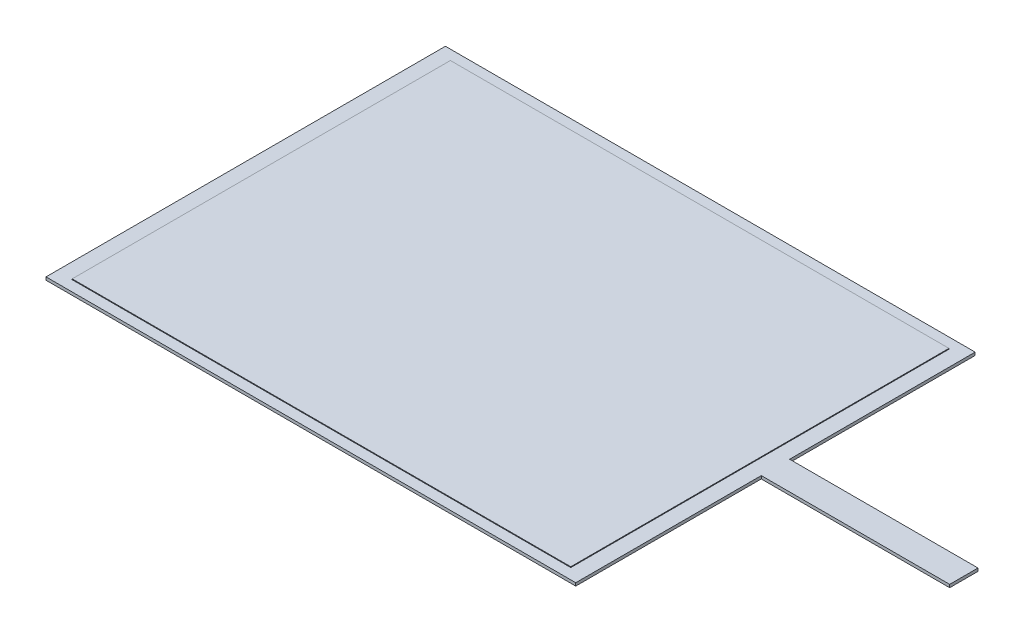
ISO-10303-21;
HEADER;
FILE_DESCRIPTION(('STEP AP214'),'2;1');
FILE_NAME('part.step','',(''),(''),'','','');
FILE_SCHEMA(('AUTOMOTIVE_DESIGN { 1 0 10303 214 1 1 1 1 }'));
ENDSEC;
DATA;
#1=APPLICATION_CONTEXT('core data for automotive mechanical design processes');
#2=APPLICATION_PROTOCOL_DEFINITION('international standard','automotive_design',2000,#1);
#3=PRODUCT_CONTEXT('',#1,'mechanical');
#4=PRODUCT('Part','Part','',(#3));
#5=PRODUCT_RELATED_PRODUCT_CATEGORY('part','',(#4));
#6=PRODUCT_DEFINITION_FORMATION('','',#4);
#7=PRODUCT_DEFINITION_CONTEXT('part definition',#1,'design');
#8=PRODUCT_DEFINITION('design','',#6,#7);
#9=PRODUCT_DEFINITION_SHAPE('','',#8);
#10=(LENGTH_UNIT() NAMED_UNIT(*) SI_UNIT(.MILLI.,.METRE.));
#11=(NAMED_UNIT(*) PLANE_ANGLE_UNIT() SI_UNIT($,.RADIAN.));
#12=(NAMED_UNIT(*) SI_UNIT($,.STERADIAN.) SOLID_ANGLE_UNIT());
#13=UNCERTAINTY_MEASURE_WITH_UNIT(LENGTH_MEASURE(1.E-05),#10,'distance_accuracy_value','');
#14=(GEOMETRIC_REPRESENTATION_CONTEXT(3) GLOBAL_UNCERTAINTY_ASSIGNED_CONTEXT((#13)) GLOBAL_UNIT_ASSIGNED_CONTEXT((#10,
#11,#12)) REPRESENTATION_CONTEXT('',''));
#15=CARTESIAN_POINT('',(0.,0.,0.));
#16=DIRECTION('',(0.,0.,1.));
#17=DIRECTION('',(1.,0.,0.));
#18=AXIS2_PLACEMENT_3D('',#15,#16,#17);
#19=CARTESIAN_POINT('',(0.,0.52,0.));
#20=DIRECTION('',(0.,1.,0.));
#21=DIRECTION('',(0.,0.,1.));
#22=AXIS2_PLACEMENT_3D('',#19,#20,#21);
#23=PLANE('',#22);
#24=DIRECTION('',(1.,0.,0.));
#25=VECTOR('',#24,1.);
#26=CARTESIAN_POINT('',(0.,0.52,70.5));
#27=LINE('',#26,#25);
#28=CARTESIAN_POINT('',(-93.5,0.52,70.5));
#29=VERTEX_POINT('',#28);
#30=CARTESIAN_POINT('',(93.5,0.52,70.5));
#31=VERTEX_POINT('',#30);
#32=EDGE_CURVE('E194',#29,#31,#27,.T.);
#33=ORIENTED_EDGE('',*,*,#32,.T.);
#34=DIRECTION('',(0.,0.,-1.));
#35=VECTOR('',#34,1.);
#36=CARTESIAN_POINT('',(93.5,0.52,0.));
#37=LINE('',#36,#35);
#38=CARTESIAN_POINT('',(93.5,0.52,5.));
#39=VERTEX_POINT('',#38);
#40=EDGE_CURVE('E197',#31,#39,#37,.T.);
#41=ORIENTED_EDGE('',*,*,#40,.T.);
#42=DIRECTION('',(-1.,0.,0.));
#43=VECTOR('',#42,1.);
#44=CARTESIAN_POINT('',(0.,0.52,4.99999999999998));
#45=LINE('',#44,#43);
#46=CARTESIAN_POINT('',(160.,0.52,5.));
#47=VERTEX_POINT('',#46);
#48=EDGE_CURVE('E200',#47,#39,#45,.T.);
#49=ORIENTED_EDGE('',*,*,#48,.F.);
#50=DIRECTION('',(0.,0.,-1.));
#51=VECTOR('',#50,1.);
#52=CARTESIAN_POINT('',(160.,0.52,0.));
#53=LINE('',#52,#51);
#54=CARTESIAN_POINT('',(160.,0.52,-5.));
#55=VERTEX_POINT('',#54);
#56=EDGE_CURVE('E204',#47,#55,#53,.T.);
#57=ORIENTED_EDGE('',*,*,#56,.T.);
#58=DIRECTION('',(-1.,0.,0.));
#59=VECTOR('',#58,1.);
#60=CARTESIAN_POINT('',(0.,0.52,-5.00000000000002));
#61=LINE('',#60,#59);
#62=CARTESIAN_POINT('',(93.5,0.52,-5.));
#63=VERTEX_POINT('',#62);
#64=EDGE_CURVE('E206',#55,#63,#61,.T.);
#65=ORIENTED_EDGE('',*,*,#64,.T.);
#66=CARTESIAN_POINT('',(93.5,0.52,-70.5));
#67=VERTEX_POINT('',#66);
#68=EDGE_CURVE('E201',#63,#67,#37,.T.);
#69=ORIENTED_EDGE('',*,*,#68,.T.);
#70=DIRECTION('',(1.,0.,0.));
#71=VECTOR('',#70,1.);
#72=CARTESIAN_POINT('',(0.,0.52,-70.5));
#73=LINE('',#72,#71);
#74=CARTESIAN_POINT('',(-93.5,0.52,-70.5));
#75=VERTEX_POINT('',#74);
#76=EDGE_CURVE('E208',#75,#67,#73,.T.);
#77=ORIENTED_EDGE('',*,*,#76,.F.);
#78=DIRECTION('',(0.,0.,-1.));
#79=VECTOR('',#78,1.);
#80=CARTESIAN_POINT('',(-93.5,0.52,0.));
#81=LINE('',#80,#79);
#82=EDGE_CURVE('E211',#29,#75,#81,.T.);
#83=ORIENTED_EDGE('',*,*,#82,.F.);
#84=EDGE_LOOP('',(#33,#41,#49,#57,#65,#69,#77,#83));
#85=FACE_BOUND('',#84,.T.);
#86=DIRECTION('',(0.,0.,1.));
#87=VECTOR('',#86,1.);
#88=CARTESIAN_POINT('',(88.,0.52,0.));
#89=LINE('',#88,#87);
#90=CARTESIAN_POINT('',(88.,0.52,-66.75));
#91=VERTEX_POINT('',#90);
#92=CARTESIAN_POINT('',(88.,0.52,66.75));
#93=VERTEX_POINT('',#92);
#94=EDGE_CURVE('E62',#91,#93,#89,.T.);
#95=ORIENTED_EDGE('',*,*,#94,.T.);
#96=DIRECTION('',(-1.,0.,0.));
#97=VECTOR('',#96,1.);
#98=CARTESIAN_POINT('',(0.,0.52,66.75));
#99=LINE('',#98,#97);
#100=CARTESIAN_POINT('',(-88.,0.52,66.75));
#101=VERTEX_POINT('',#100);
#102=EDGE_CURVE('E181',#93,#101,#99,.T.);
#103=ORIENTED_EDGE('',*,*,#102,.T.);
#104=DIRECTION('',(0.,0.,1.));
#105=VECTOR('',#104,1.);
#106=CARTESIAN_POINT('',(-88.,0.52,0.));
#107=LINE('',#106,#105);
#108=CARTESIAN_POINT('',(-88.,0.52,-66.75));
#109=VERTEX_POINT('',#108);
#110=EDGE_CURVE('E182',#109,#101,#107,.T.);
#111=ORIENTED_EDGE('',*,*,#110,.F.);
#112=DIRECTION('',(-1.,0.,0.));
#113=VECTOR('',#112,1.);
#114=CARTESIAN_POINT('',(0.,0.52,-66.75));
#115=LINE('',#114,#113);
#116=EDGE_CURVE('E67',#91,#109,#115,.T.);
#117=ORIENTED_EDGE('',*,*,#116,.F.);
#118=EDGE_LOOP('',(#95,#103,#111,#117));
#119=FACE_BOUND('',#118,.T.);
#120=ADVANCED_FACE('F47',(#85,#119),#23,.T.);
#121=CARTESIAN_POINT('',(0.,-0.52,0.));
#122=DIRECTION('',(0.,1.,0.));
#123=DIRECTION('',(0.,0.,1.));
#124=AXIS2_PLACEMENT_3D('',#121,#122,#123);
#125=PLANE('',#124);
#126=DIRECTION('',(1.,0.,0.));
#127=VECTOR('',#126,1.);
#128=CARTESIAN_POINT('',(0.,-0.52,70.5));
#129=LINE('',#128,#127);
#130=CARTESIAN_POINT('',(-93.5,-0.52,70.5));
#131=VERTEX_POINT('',#130);
#132=CARTESIAN_POINT('',(93.5,-0.52,70.5));
#133=VERTEX_POINT('',#132);
#134=EDGE_CURVE('E193',#131,#133,#129,.T.);
#135=ORIENTED_EDGE('',*,*,#134,.F.);
#136=DIRECTION('',(0.,0.,-1.));
#137=VECTOR('',#136,1.);
#138=CARTESIAN_POINT('',(-93.5,-0.52,0.));
#139=LINE('',#138,#137);
#140=CARTESIAN_POINT('',(-93.5,-0.52,-70.5));
#141=VERTEX_POINT('',#140);
#142=EDGE_CURVE('E198',#131,#141,#139,.T.);
#143=ORIENTED_EDGE('',*,*,#142,.T.);
#144=DIRECTION('',(1.,0.,0.));
#145=VECTOR('',#144,1.);
#146=CARTESIAN_POINT('',(0.,-0.52,-70.5));
#147=LINE('',#146,#145);
#148=CARTESIAN_POINT('',(93.5,-0.52,-70.5));
#149=VERTEX_POINT('',#148);
#150=EDGE_CURVE('E228',#141,#149,#147,.T.);
#151=ORIENTED_EDGE('',*,*,#150,.T.);
#152=DIRECTION('',(0.,0.,-1.));
#153=VECTOR('',#152,1.);
#154=CARTESIAN_POINT('',(93.5,-0.52,0.));
#155=LINE('',#154,#153);
#156=CARTESIAN_POINT('',(93.5,-0.52,-5.));
#157=VERTEX_POINT('',#156);
#158=EDGE_CURVE('E221',#157,#149,#155,.T.);
#159=ORIENTED_EDGE('',*,*,#158,.F.);
#160=DIRECTION('',(-1.,0.,0.));
#161=VECTOR('',#160,1.);
#162=CARTESIAN_POINT('',(0.,-0.52,-5.00000000000002));
#163=LINE('',#162,#161);
#164=CARTESIAN_POINT('',(160.,-0.52,-5.));
#165=VERTEX_POINT('',#164);
#166=EDGE_CURVE('E226',#165,#157,#163,.T.);
#167=ORIENTED_EDGE('',*,*,#166,.F.);
#168=DIRECTION('',(0.,0.,-1.));
#169=VECTOR('',#168,1.);
#170=CARTESIAN_POINT('',(160.,-0.52,0.));
#171=LINE('',#170,#169);
#172=CARTESIAN_POINT('',(160.,-0.52,5.));
#173=VERTEX_POINT('',#172);
#174=EDGE_CURVE('E224',#173,#165,#171,.T.);
#175=ORIENTED_EDGE('',*,*,#174,.F.);
#176=DIRECTION('',(-1.,0.,0.));
#177=VECTOR('',#176,1.);
#178=CARTESIAN_POINT('',(0.,-0.52,4.99999999999998));
#179=LINE('',#178,#177);
#180=CARTESIAN_POINT('',(93.5,-0.52,5.));
#181=VERTEX_POINT('',#180);
#182=EDGE_CURVE('E220',#173,#181,#179,.T.);
#183=ORIENTED_EDGE('',*,*,#182,.T.);
#184=EDGE_CURVE('E217',#133,#181,#155,.T.);
#185=ORIENTED_EDGE('',*,*,#184,.F.);
#186=EDGE_LOOP('',(#135,#143,#151,#159,#167,#175,#183,#185));
#187=FACE_BOUND('',#186,.T.);
#188=DIRECTION('',(-1.,0.,0.));
#189=VECTOR('',#188,1.);
#190=CARTESIAN_POINT('',(0.,-0.52,66.75));
#191=LINE('',#190,#189);
#192=CARTESIAN_POINT('',(88.,-0.52,66.75));
#193=VERTEX_POINT('',#192);
#194=CARTESIAN_POINT('',(-88.,-0.52,66.75));
#195=VERTEX_POINT('',#194);
#196=EDGE_CURVE('E11',#193,#195,#191,.T.);
#197=ORIENTED_EDGE('',*,*,#196,.F.);
#198=DIRECTION('',(0.,0.,1.));
#199=VECTOR('',#198,1.);
#200=CARTESIAN_POINT('',(88.,-0.52,0.));
#201=LINE('',#200,#199);
#202=CARTESIAN_POINT('',(88.,-0.52,-66.75));
#203=VERTEX_POINT('',#202);
#204=EDGE_CURVE('E55',#203,#193,#201,.T.);
#205=ORIENTED_EDGE('',*,*,#204,.F.);
#206=DIRECTION('',(-1.,0.,0.));
#207=VECTOR('',#206,1.);
#208=CARTESIAN_POINT('',(0.,-0.52,-66.75));
#209=LINE('',#208,#207);
#210=CARTESIAN_POINT('',(-88.,-0.52,-66.75));
#211=VERTEX_POINT('',#210);
#212=EDGE_CURVE('E254',#203,#211,#209,.T.);
#213=ORIENTED_EDGE('',*,*,#212,.T.);
#214=DIRECTION('',(0.,0.,1.));
#215=VECTOR('',#214,1.);
#216=CARTESIAN_POINT('',(-88.,-0.52,0.));
#217=LINE('',#216,#215);
#218=EDGE_CURVE('E251',#211,#195,#217,.T.);
#219=ORIENTED_EDGE('',*,*,#218,.T.);
#220=EDGE_LOOP('',(#197,#205,#213,#219));
#221=FACE_BOUND('',#220,.T.);
#222=ADVANCED_FACE('F271',(#187,#221),#125,.F.);
#223=CARTESIAN_POINT('',(0.,0.52,70.5));
#224=DIRECTION('',(0.,0.,-1.));
#225=DIRECTION('',(-1.,0.,0.));
#226=AXIS2_PLACEMENT_3D('',#223,#224,#225);
#227=PLANE('',#226);
#228=ORIENTED_EDGE('',*,*,#134,.T.);
#229=DIRECTION('',(0.,-1.,0.));
#230=VECTOR('',#229,1.);
#231=CARTESIAN_POINT('',(93.5,0.52,70.5));
#232=LINE('',#231,#230);
#233=EDGE_CURVE('E248',#31,#133,#232,.T.);
#234=ORIENTED_EDGE('',*,*,#233,.F.);
#235=ORIENTED_EDGE('',*,*,#32,.F.);
#236=DIRECTION('',(0.,-1.,0.));
#237=VECTOR('',#236,1.);
#238=CARTESIAN_POINT('',(-93.5,0.52,70.5));
#239=LINE('',#238,#237);
#240=EDGE_CURVE('E214',#29,#131,#239,.T.);
#241=ORIENTED_EDGE('',*,*,#240,.T.);
#242=EDGE_LOOP('',(#228,#234,#235,#241));
#243=FACE_BOUND('',#242,.T.);
#244=ADVANCED_FACE('F49',(#243),#227,.F.);
#245=CARTESIAN_POINT('',(93.5,0.52,0.));
#246=DIRECTION('',(-1.,0.,0.));
#247=DIRECTION('',(0.,0.,1.));
#248=AXIS2_PLACEMENT_3D('',#245,#246,#247);
#249=PLANE('',#248);
#250=ORIENTED_EDGE('',*,*,#184,.T.);
#251=DIRECTION('',(0.,-1.,0.));
#252=VECTOR('',#251,1.);
#253=CARTESIAN_POINT('',(93.5,0.52,5.));
#254=LINE('',#253,#252);
#255=EDGE_CURVE('E246',#39,#181,#254,.T.);
#256=ORIENTED_EDGE('',*,*,#255,.F.);
#257=ORIENTED_EDGE('',*,*,#40,.F.);
#258=ORIENTED_EDGE('',*,*,#233,.T.);
#259=EDGE_LOOP('',(#250,#256,#257,#258));
#260=FACE_BOUND('',#259,.T.);
#261=ADVANCED_FACE('F324',(#260),#249,.F.);
#262=CARTESIAN_POINT('',(0.,0.52,4.99999999999998));
#263=DIRECTION('',(0.,0.,1.));
#264=DIRECTION('',(1.,0.,0.));
#265=AXIS2_PLACEMENT_3D('',#262,#263,#264);
#266=PLANE('',#265);
#267=ORIENTED_EDGE('',*,*,#182,.F.);
#268=DIRECTION('',(0.,-1.,0.));
#269=VECTOR('',#268,1.);
#270=CARTESIAN_POINT('',(160.,0.52,5.));
#271=LINE('',#270,#269);
#272=EDGE_CURVE('E244',#47,#173,#271,.T.);
#273=ORIENTED_EDGE('',*,*,#272,.F.);
#274=ORIENTED_EDGE('',*,*,#48,.T.);
#275=ORIENTED_EDGE('',*,*,#255,.T.);
#276=EDGE_LOOP('',(#267,#273,#274,#275));
#277=FACE_BOUND('',#276,.T.);
#278=ADVANCED_FACE('F330',(#277),#266,.T.);
#279=CARTESIAN_POINT('',(160.,0.52,0.));
#280=DIRECTION('',(-1.,0.,0.));
#281=DIRECTION('',(0.,0.,1.));
#282=AXIS2_PLACEMENT_3D('',#279,#280,#281);
#283=PLANE('',#282);
#284=ORIENTED_EDGE('',*,*,#174,.T.);
#285=DIRECTION('',(0.,-1.,0.));
#286=VECTOR('',#285,1.);
#287=CARTESIAN_POINT('',(160.,0.52,-5.));
#288=LINE('',#287,#286);
#289=EDGE_CURVE('E241',#55,#165,#288,.T.);
#290=ORIENTED_EDGE('',*,*,#289,.F.);
#291=ORIENTED_EDGE('',*,*,#56,.F.);
#292=ORIENTED_EDGE('',*,*,#272,.T.);
#293=EDGE_LOOP('',(#284,#290,#291,#292));
#294=FACE_BOUND('',#293,.T.);
#295=ADVANCED_FACE('F327',(#294),#283,.F.);
#296=CARTESIAN_POINT('',(0.,0.52,-5.00000000000002));
#297=DIRECTION('',(0.,0.,1.));
#298=DIRECTION('',(1.,0.,0.));
#299=AXIS2_PLACEMENT_3D('',#296,#297,#298);
#300=PLANE('',#299);
#301=ORIENTED_EDGE('',*,*,#166,.T.);
#302=DIRECTION('',(0.,-1.,0.));
#303=VECTOR('',#302,1.);
#304=CARTESIAN_POINT('',(93.5,0.52,-5.));
#305=LINE('',#304,#303);
#306=EDGE_CURVE('E238',#63,#157,#305,.T.);
#307=ORIENTED_EDGE('',*,*,#306,.F.);
#308=ORIENTED_EDGE('',*,*,#64,.F.);
#309=ORIENTED_EDGE('',*,*,#289,.T.);
#310=EDGE_LOOP('',(#301,#307,#308,#309));
#311=FACE_BOUND('',#310,.T.);
#312=ADVANCED_FACE('F322',(#311),#300,.F.);
#313=ORIENTED_EDGE('',*,*,#158,.T.);
#314=DIRECTION('',(0.,-1.,0.));
#315=VECTOR('',#314,1.);
#316=CARTESIAN_POINT('',(93.5,0.52,-70.5));
#317=LINE('',#316,#315);
#318=EDGE_CURVE('E236',#67,#149,#317,.T.);
#319=ORIENTED_EDGE('',*,*,#318,.F.);
#320=ORIENTED_EDGE('',*,*,#68,.F.);
#321=ORIENTED_EDGE('',*,*,#306,.T.);
#322=EDGE_LOOP('',(#313,#319,#320,#321));
#323=FACE_BOUND('',#322,.T.);
#324=ADVANCED_FACE('F318',(#323),#249,.F.);
#325=CARTESIAN_POINT('',(0.,0.52,-70.5));
#326=DIRECTION('',(0.,0.,-1.));
#327=DIRECTION('',(-1.,0.,0.));
#328=AXIS2_PLACEMENT_3D('',#325,#326,#327);
#329=PLANE('',#328);
#330=ORIENTED_EDGE('',*,*,#150,.F.);
#331=DIRECTION('',(0.,-1.,0.));
#332=VECTOR('',#331,1.);
#333=CARTESIAN_POINT('',(-93.5,0.52,-70.5));
#334=LINE('',#333,#332);
#335=EDGE_CURVE('E234',#75,#141,#334,.T.);
#336=ORIENTED_EDGE('',*,*,#335,.F.);
#337=ORIENTED_EDGE('',*,*,#76,.T.);
#338=ORIENTED_EDGE('',*,*,#318,.T.);
#339=EDGE_LOOP('',(#330,#336,#337,#338));
#340=FACE_BOUND('',#339,.T.);
#341=ADVANCED_FACE('F314',(#340),#329,.T.);
#342=CARTESIAN_POINT('',(-93.5,0.52,0.));
#343=DIRECTION('',(-1.,0.,0.));
#344=DIRECTION('',(0.,0.,1.));
#345=AXIS2_PLACEMENT_3D('',#342,#343,#344);
#346=PLANE('',#345);
#347=ORIENTED_EDGE('',*,*,#142,.F.);
#348=ORIENTED_EDGE('',*,*,#240,.F.);
#349=ORIENTED_EDGE('',*,*,#82,.T.);
#350=ORIENTED_EDGE('',*,*,#335,.T.);
#351=EDGE_LOOP('',(#347,#348,#349,#350));
#352=FACE_BOUND('',#351,.T.);
#353=ADVANCED_FACE('F311',(#352),#346,.T.);
#354=CARTESIAN_POINT('',(0.,-0.79,0.));
#355=DIRECTION('',(0.,1.,0.));
#356=DIRECTION('',(0.,0.,1.));
#357=AXIS2_PLACEMENT_3D('',#354,#355,#356);
#358=PLANE('',#357);
#359=DIRECTION('',(1.,0.,0.));
#360=VECTOR('',#359,1.);
#361=CARTESIAN_POINT('',(0.,-0.79,66.75));
#362=LINE('',#361,#360);
#363=CARTESIAN_POINT('',(-88.,-0.79,66.75));
#364=VERTEX_POINT('',#363);
#365=CARTESIAN_POINT('',(88.,-0.79,66.75));
#366=VERTEX_POINT('',#365);
#367=EDGE_CURVE('E270',#364,#366,#362,.T.);
#368=ORIENTED_EDGE('',*,*,#367,.F.);
#369=DIRECTION('',(0.,0.,-1.));
#370=VECTOR('',#369,1.);
#371=CARTESIAN_POINT('',(-88.,-0.79,0.));
#372=LINE('',#371,#370);
#373=CARTESIAN_POINT('',(-88.,-0.79,-66.75));
#374=VERTEX_POINT('',#373);
#375=EDGE_CURVE('E178',#364,#374,#372,.T.);
#376=ORIENTED_EDGE('',*,*,#375,.T.);
#377=DIRECTION('',(1.,0.,0.));
#378=VECTOR('',#377,1.);
#379=CARTESIAN_POINT('',(0.,-0.79,-66.75));
#380=LINE('',#379,#378);
#381=CARTESIAN_POINT('',(88.,-0.79,-66.75));
#382=VERTEX_POINT('',#381);
#383=EDGE_CURVE('E282',#374,#382,#380,.T.);
#384=ORIENTED_EDGE('',*,*,#383,.T.);
#385=DIRECTION('',(0.,0.,-1.));
#386=VECTOR('',#385,1.);
#387=CARTESIAN_POINT('',(88.,-0.79,0.));
#388=LINE('',#387,#386);
#389=EDGE_CURVE('E291',#366,#382,#388,.T.);
#390=ORIENTED_EDGE('',*,*,#389,.F.);
#391=EDGE_LOOP('',(#368,#376,#384,#390));
#392=FACE_BOUND('',#391,.T.);
#393=ADVANCED_FACE('F313',(#392),#358,.F.);
#394=CARTESIAN_POINT('',(-88.,0.79,0.));
#395=DIRECTION('',(-1.,0.,0.));
#396=DIRECTION('',(0.,0.,1.));
#397=AXIS2_PLACEMENT_3D('',#394,#395,#396);
#398=PLANE('',#397);
#399=ORIENTED_EDGE('',*,*,#218,.F.);
#400=DIRECTION('',(0.,-1.,0.));
#401=VECTOR('',#400,1.);
#402=CARTESIAN_POINT('',(-88.,0.79,-66.75));
#403=LINE('',#402,#401);
#404=EDGE_CURVE('E276',#211,#374,#403,.T.);
#405=ORIENTED_EDGE('',*,*,#404,.T.);
#406=ORIENTED_EDGE('',*,*,#375,.F.);
#407=DIRECTION('',(0.,-1.,0.));
#408=VECTOR('',#407,1.);
#409=CARTESIAN_POINT('',(-88.,0.79,66.75));
#410=LINE('',#409,#408);
#411=EDGE_CURVE('E278',#195,#364,#410,.T.);
#412=ORIENTED_EDGE('',*,*,#411,.F.);
#413=EDGE_LOOP('',(#399,#405,#406,#412));
#414=FACE_BOUND('',#413,.T.);
#415=ADVANCED_FACE('F274',(#414),#398,.T.);
#416=CARTESIAN_POINT('',(0.,0.79,-66.75));
#417=DIRECTION('',(0.,0.,-1.));
#418=DIRECTION('',(-1.,0.,0.));
#419=AXIS2_PLACEMENT_3D('',#416,#417,#418);
#420=PLANE('',#419);
#421=ORIENTED_EDGE('',*,*,#212,.F.);
#422=DIRECTION('',(0.,-1.,0.));
#423=VECTOR('',#422,1.);
#424=CARTESIAN_POINT('',(88.,0.79,-66.75));
#425=LINE('',#424,#423);
#426=EDGE_CURVE('E263',#203,#382,#425,.T.);
#427=ORIENTED_EDGE('',*,*,#426,.T.);
#428=ORIENTED_EDGE('',*,*,#383,.F.);
#429=ORIENTED_EDGE('',*,*,#404,.F.);
#430=EDGE_LOOP('',(#421,#427,#428,#429));
#431=FACE_BOUND('',#430,.T.);
#432=ADVANCED_FACE('F280',(#431),#420,.T.);
#433=CARTESIAN_POINT('',(88.,0.79,0.));
#434=DIRECTION('',(-1.,0.,0.));
#435=DIRECTION('',(0.,0.,1.));
#436=AXIS2_PLACEMENT_3D('',#433,#434,#435);
#437=PLANE('',#436);
#438=ORIENTED_EDGE('',*,*,#426,.F.);
#439=ORIENTED_EDGE('',*,*,#204,.T.);
#440=DIRECTION('',(0.,-1.,0.));
#441=VECTOR('',#440,1.);
#442=CARTESIAN_POINT('',(88.,0.79,66.75));
#443=LINE('',#442,#441);
#444=EDGE_CURVE('E183',#193,#366,#443,.T.);
#445=ORIENTED_EDGE('',*,*,#444,.T.);
#446=ORIENTED_EDGE('',*,*,#389,.T.);
#447=EDGE_LOOP('',(#438,#439,#445,#446));
#448=FACE_BOUND('',#447,.T.);
#449=ADVANCED_FACE('F260',(#448),#437,.F.);
#450=CARTESIAN_POINT('',(0.,0.79,66.75));
#451=DIRECTION('',(0.,0.,-1.));
#452=DIRECTION('',(-1.,0.,0.));
#453=AXIS2_PLACEMENT_3D('',#450,#451,#452);
#454=PLANE('',#453);
#455=ORIENTED_EDGE('',*,*,#444,.F.);
#456=ORIENTED_EDGE('',*,*,#196,.T.);
#457=ORIENTED_EDGE('',*,*,#411,.T.);
#458=ORIENTED_EDGE('',*,*,#367,.T.);
#459=EDGE_LOOP('',(#455,#456,#457,#458));
#460=FACE_BOUND('',#459,.T.);
#461=ADVANCED_FACE('F268',(#460),#454,.F.);
#462=ORIENTED_EDGE('',*,*,#102,.F.);
#463=CARTESIAN_POINT('',(88.,0.79,66.75));
#464=VERTEX_POINT('',#463);
#465=EDGE_CURVE('E162',#464,#93,#443,.T.);
#466=ORIENTED_EDGE('',*,*,#465,.F.);
#467=DIRECTION('',(1.,0.,0.));
#468=VECTOR('',#467,1.);
#469=CARTESIAN_POINT('',(0.,0.79,66.75));
#470=LINE('',#469,#468);
#471=CARTESIAN_POINT('',(-88.,0.79,66.75));
#472=VERTEX_POINT('',#471);
#473=EDGE_CURVE('E169',#472,#464,#470,.T.);
#474=ORIENTED_EDGE('',*,*,#473,.F.);
#475=EDGE_CURVE('E285',#472,#101,#410,.T.);
#476=ORIENTED_EDGE('',*,*,#475,.T.);
#477=EDGE_LOOP('',(#462,#466,#474,#476));
#478=FACE_BOUND('',#477,.T.);
#479=ADVANCED_FACE('F180',(#478),#454,.F.);
#480=ORIENTED_EDGE('',*,*,#94,.F.);
#481=CARTESIAN_POINT('',(88.,0.79,-66.75));
#482=VERTEX_POINT('',#481);
#483=EDGE_CURVE('E164',#482,#91,#425,.T.);
#484=ORIENTED_EDGE('',*,*,#483,.F.);
#485=DIRECTION('',(0.,0.,-1.));
#486=VECTOR('',#485,1.);
#487=CARTESIAN_POINT('',(88.,0.79,0.));
#488=LINE('',#487,#486);
#489=EDGE_CURVE('E158',#464,#482,#488,.T.);
#490=ORIENTED_EDGE('',*,*,#489,.F.);
#491=ORIENTED_EDGE('',*,*,#465,.T.);
#492=EDGE_LOOP('',(#480,#484,#490,#491));
#493=FACE_BOUND('',#492,.T.);
#494=ADVANCED_FACE('F160',(#493),#437,.F.);
#495=ORIENTED_EDGE('',*,*,#483,.T.);
#496=ORIENTED_EDGE('',*,*,#116,.T.);
#497=CARTESIAN_POINT('',(-88.,0.79,-66.75));
#498=VERTEX_POINT('',#497);
#499=EDGE_CURVE('E284',#498,#109,#403,.T.);
#500=ORIENTED_EDGE('',*,*,#499,.F.);
#501=DIRECTION('',(1.,0.,0.));
#502=VECTOR('',#501,1.);
#503=CARTESIAN_POINT('',(0.,0.79,-66.75));
#504=LINE('',#503,#502);
#505=EDGE_CURVE('E168',#498,#482,#504,.T.);
#506=ORIENTED_EDGE('',*,*,#505,.T.);
#507=EDGE_LOOP('',(#495,#496,#500,#506));
#508=FACE_BOUND('',#507,.T.);
#509=ADVANCED_FACE('F296',(#508),#420,.T.);
#510=ORIENTED_EDGE('',*,*,#499,.T.);
#511=ORIENTED_EDGE('',*,*,#110,.T.);
#512=ORIENTED_EDGE('',*,*,#475,.F.);
#513=DIRECTION('',(0.,0.,-1.));
#514=VECTOR('',#513,1.);
#515=CARTESIAN_POINT('',(-88.,0.79,0.));
#516=LINE('',#515,#514);
#517=EDGE_CURVE('E175',#472,#498,#516,.T.);
#518=ORIENTED_EDGE('',*,*,#517,.T.);
#519=EDGE_LOOP('',(#510,#511,#512,#518));
#520=FACE_BOUND('',#519,.T.);
#521=ADVANCED_FACE('F298',(#520),#398,.T.);
#522=CARTESIAN_POINT('',(0.,0.79,0.));
#523=DIRECTION('',(0.,1.,0.));
#524=DIRECTION('',(0.,0.,1.));
#525=AXIS2_PLACEMENT_3D('',#522,#523,#524);
#526=PLANE('',#525);
#527=ORIENTED_EDGE('',*,*,#473,.T.);
#528=ORIENTED_EDGE('',*,*,#489,.T.);
#529=ORIENTED_EDGE('',*,*,#505,.F.);
#530=ORIENTED_EDGE('',*,*,#517,.F.);
#531=EDGE_LOOP('',(#527,#528,#529,#530));
#532=FACE_BOUND('',#531,.T.);
#533=ADVANCED_FACE('F173',(#532),#526,.T.);
#534=CLOSED_SHELL('',(#120,#222,#244,#261,#278,#295,#312,#324,#341,#353,#393,#415,#432,#449,
#461,#479,#494,#509,#521,#533));
#535=MANIFOLD_SOLID_BREP('B2',#534);
#536=ADVANCED_BREP_SHAPE_REPRESENTATION('',(#18,#535),#14);
#537=SHAPE_DEFINITION_REPRESENTATION(#9,#536);
ENDSEC;
END-ISO-10303-21;
